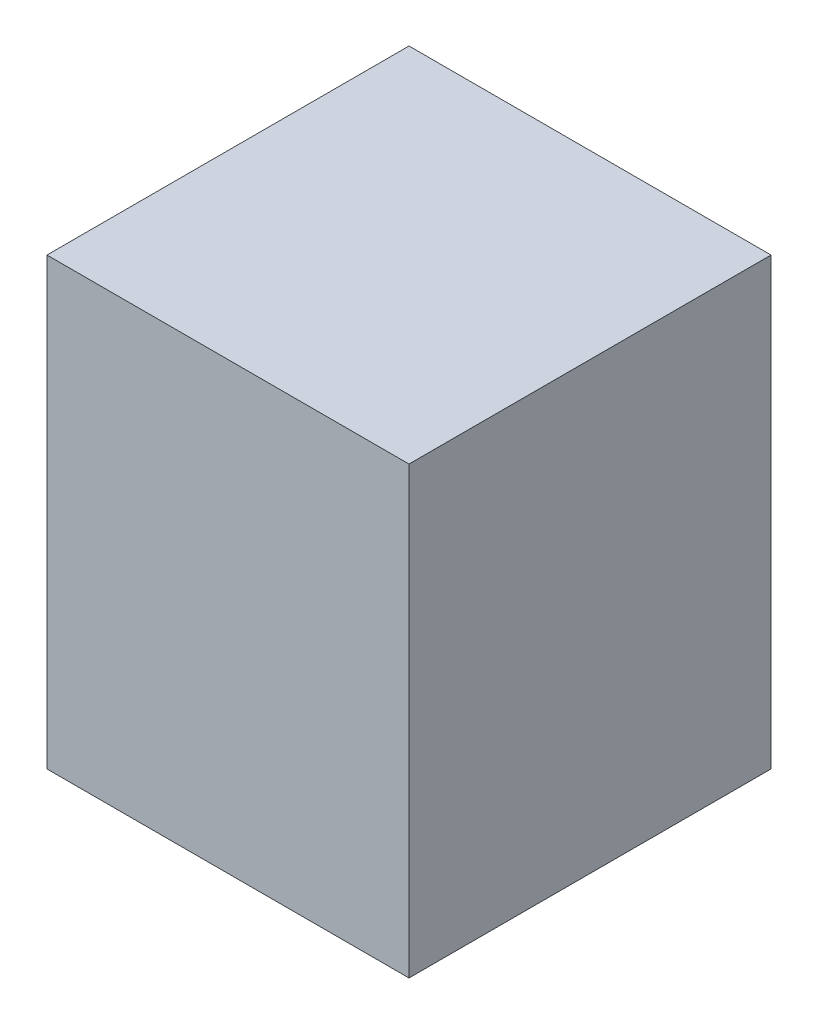
ISO-10303-21;
HEADER;
FILE_DESCRIPTION(('STEP AP214'),'2;1');
FILE_NAME('part.step','',(''),(''),'','','');
FILE_SCHEMA(('AUTOMOTIVE_DESIGN { 1 0 10303 214 1 1 1 1 }'));
ENDSEC;
DATA;
#1=APPLICATION_CONTEXT('core data for automotive mechanical design processes');
#2=APPLICATION_PROTOCOL_DEFINITION('international standard','automotive_design',2000,#1);
#3=PRODUCT_CONTEXT('',#1,'mechanical');
#4=PRODUCT('Part','Part','',(#3));
#5=PRODUCT_RELATED_PRODUCT_CATEGORY('part','',(#4));
#6=PRODUCT_DEFINITION_FORMATION('','',#4);
#7=PRODUCT_DEFINITION_CONTEXT('part definition',#1,'design');
#8=PRODUCT_DEFINITION('design','',#6,#7);
#9=PRODUCT_DEFINITION_SHAPE('','',#8);
#10=(LENGTH_UNIT() NAMED_UNIT(*) SI_UNIT(.MILLI.,.METRE.));
#11=(NAMED_UNIT(*) PLANE_ANGLE_UNIT() SI_UNIT($,.RADIAN.));
#12=(NAMED_UNIT(*) SI_UNIT($,.STERADIAN.) SOLID_ANGLE_UNIT());
#13=UNCERTAINTY_MEASURE_WITH_UNIT(LENGTH_MEASURE(1.E-05),#10,'distance_accuracy_value','');
#14=(GEOMETRIC_REPRESENTATION_CONTEXT(3) GLOBAL_UNCERTAINTY_ASSIGNED_CONTEXT((#13)) GLOBAL_UNIT_ASSIGNED_CONTEXT((#10,
#11,#12)) REPRESENTATION_CONTEXT('',''));
#15=CARTESIAN_POINT('',(0.,0.,0.));
#16=DIRECTION('',(0.,0.,1.));
#17=DIRECTION('',(1.,0.,0.));
#18=AXIS2_PLACEMENT_3D('',#15,#16,#17);
#19=CARTESIAN_POINT('',(193.675,238.125,193.675));
#20=DIRECTION('',(-1.,0.,0.));
#21=DIRECTION('',(0.,0.,1.));
#22=AXIS2_PLACEMENT_3D('',#19,#20,#21);
#23=PLANE('',#22);
#24=DIRECTION('',(0.,0.,-1.));
#25=VECTOR('',#24,1.);
#26=CARTESIAN_POINT('',(193.675,-238.125,193.675));
#27=LINE('',#26,#25);
#28=CARTESIAN_POINT('',(193.675,-238.125,193.675));
#29=VERTEX_POINT('',#28);
#30=CARTESIAN_POINT('',(193.675,-238.125,-193.675));
#31=VERTEX_POINT('',#30);
#32=EDGE_CURVE('E106',#29,#31,#27,.T.);
#33=ORIENTED_EDGE('',*,*,#32,.T.);
#34=DIRECTION('',(0.,-1.,0.));
#35=VECTOR('',#34,1.);
#36=CARTESIAN_POINT('',(193.675,238.125,-193.675));
#37=LINE('',#36,#35);
#38=CARTESIAN_POINT('',(193.675,238.125,-193.675));
#39=VERTEX_POINT('',#38);
#40=EDGE_CURVE('E11',#39,#31,#37,.T.);
#41=ORIENTED_EDGE('',*,*,#40,.F.);
#42=DIRECTION('',(0.,0.,-1.));
#43=VECTOR('',#42,1.);
#44=CARTESIAN_POINT('',(193.675,238.125,193.675));
#45=LINE('',#44,#43);
#46=CARTESIAN_POINT('',(193.675,238.125,193.675));
#47=VERTEX_POINT('',#46);
#48=EDGE_CURVE('E93',#47,#39,#45,.T.);
#49=ORIENTED_EDGE('',*,*,#48,.F.);
#50=DIRECTION('',(0.,-1.,0.));
#51=VECTOR('',#50,1.);
#52=CARTESIAN_POINT('',(193.675,238.125,193.675));
#53=LINE('',#52,#51);
#54=EDGE_CURVE('E102',#47,#29,#53,.T.);
#55=ORIENTED_EDGE('',*,*,#54,.T.);
#56=EDGE_LOOP('',(#33,#41,#49,#55));
#57=FACE_BOUND('',#56,.T.);
#58=ADVANCED_FACE('F40',(#57),#23,.F.);
#59=CARTESIAN_POINT('',(-193.675,238.125,-193.675));
#60=DIRECTION('',(0.,0.,1.));
#61=DIRECTION('',(1.,0.,0.));
#62=AXIS2_PLACEMENT_3D('',#59,#60,#61);
#63=PLANE('',#62);
#64=DIRECTION('',(-1.,0.,0.));
#65=VECTOR('',#64,1.);
#66=CARTESIAN_POINT('',(-193.675,-238.125,-193.675));
#67=LINE('',#66,#65);
#68=CARTESIAN_POINT('',(-193.675,-238.125,-193.675));
#69=VERTEX_POINT('',#68);
#70=EDGE_CURVE('E97',#31,#69,#67,.T.);
#71=ORIENTED_EDGE('',*,*,#70,.T.);
#72=DIRECTION('',(0.,-1.,0.));
#73=VECTOR('',#72,1.);
#74=CARTESIAN_POINT('',(-193.675,238.125,-193.675));
#75=LINE('',#74,#73);
#76=CARTESIAN_POINT('',(-193.675,238.125,-193.675));
#77=VERTEX_POINT('',#76);
#78=EDGE_CURVE('E49',#77,#69,#75,.T.);
#79=ORIENTED_EDGE('',*,*,#78,.F.);
#80=DIRECTION('',(-1.,0.,0.));
#81=VECTOR('',#80,1.);
#82=CARTESIAN_POINT('',(-193.675,238.125,-193.675));
#83=LINE('',#82,#81);
#84=EDGE_CURVE('E88',#39,#77,#83,.T.);
#85=ORIENTED_EDGE('',*,*,#84,.F.);
#86=ORIENTED_EDGE('',*,*,#40,.T.);
#87=EDGE_LOOP('',(#71,#79,#85,#86));
#88=FACE_BOUND('',#87,.T.);
#89=ADVANCED_FACE('F96',(#88),#63,.F.);
#90=CARTESIAN_POINT('',(-193.675,238.125,193.675));
#91=DIRECTION('',(1.,0.,0.));
#92=DIRECTION('',(0.,0.,-1.));
#93=AXIS2_PLACEMENT_3D('',#90,#91,#92);
#94=PLANE('',#93);
#95=DIRECTION('',(0.,0.,1.));
#96=VECTOR('',#95,1.);
#97=CARTESIAN_POINT('',(-193.675,-238.125,193.675));
#98=LINE('',#97,#96);
#99=CARTESIAN_POINT('',(-193.675,-238.125,193.675));
#100=VERTEX_POINT('',#99);
#101=EDGE_CURVE('E75',#69,#100,#98,.T.);
#102=ORIENTED_EDGE('',*,*,#101,.T.);
#103=DIRECTION('',(0.,-1.,0.));
#104=VECTOR('',#103,1.);
#105=CARTESIAN_POINT('',(-193.675,238.125,193.675));
#106=LINE('',#105,#104);
#107=CARTESIAN_POINT('',(-193.675,238.125,193.675));
#108=VERTEX_POINT('',#107);
#109=EDGE_CURVE('E98',#108,#100,#106,.T.);
#110=ORIENTED_EDGE('',*,*,#109,.F.);
#111=DIRECTION('',(0.,0.,1.));
#112=VECTOR('',#111,1.);
#113=CARTESIAN_POINT('',(-193.675,238.125,193.675));
#114=LINE('',#113,#112);
#115=EDGE_CURVE('E91',#77,#108,#114,.T.);
#116=ORIENTED_EDGE('',*,*,#115,.F.);
#117=ORIENTED_EDGE('',*,*,#78,.T.);
#118=EDGE_LOOP('',(#102,#110,#116,#117));
#119=FACE_BOUND('',#118,.T.);
#120=ADVANCED_FACE('F99',(#119),#94,.F.);
#121=CARTESIAN_POINT('',(-193.675,238.125,193.675));
#122=DIRECTION('',(0.,0.,-1.));
#123=DIRECTION('',(-1.,0.,0.));
#124=AXIS2_PLACEMENT_3D('',#121,#122,#123);
#125=PLANE('',#124);
#126=DIRECTION('',(1.,0.,0.));
#127=VECTOR('',#126,1.);
#128=CARTESIAN_POINT('',(-193.675,-238.125,193.675));
#129=LINE('',#128,#127);
#130=EDGE_CURVE('E81',#100,#29,#129,.T.);
#131=ORIENTED_EDGE('',*,*,#130,.T.);
#132=ORIENTED_EDGE('',*,*,#54,.F.);
#133=DIRECTION('',(1.,0.,0.));
#134=VECTOR('',#133,1.);
#135=CARTESIAN_POINT('',(-193.675,238.125,193.675));
#136=LINE('',#135,#134);
#137=EDGE_CURVE('E57',#108,#47,#136,.T.);
#138=ORIENTED_EDGE('',*,*,#137,.F.);
#139=ORIENTED_EDGE('',*,*,#109,.T.);
#140=EDGE_LOOP('',(#131,#132,#138,#139));
#141=FACE_BOUND('',#140,.T.);
#142=ADVANCED_FACE('F118',(#141),#125,.F.);
#143=CARTESIAN_POINT('',(0.,238.125,0.));
#144=DIRECTION('',(0.,-1.,0.));
#145=DIRECTION('',(0.,0.,-1.));
#146=AXIS2_PLACEMENT_3D('',#143,#144,#145);
#147=PLANE('',#146);
#148=ORIENTED_EDGE('',*,*,#48,.T.);
#149=ORIENTED_EDGE('',*,*,#84,.T.);
#150=ORIENTED_EDGE('',*,*,#115,.T.);
#151=ORIENTED_EDGE('',*,*,#137,.T.);
#152=EDGE_LOOP('',(#148,#149,#150,#151));
#153=FACE_BOUND('',#152,.T.);
#154=ADVANCED_FACE('F89',(#153),#147,.F.);
#155=CARTESIAN_POINT('',(0.,-238.125,0.));
#156=DIRECTION('',(0.,-1.,0.));
#157=DIRECTION('',(0.,0.,-1.));
#158=AXIS2_PLACEMENT_3D('',#155,#156,#157);
#159=PLANE('',#158);
#160=ORIENTED_EDGE('',*,*,#32,.F.);
#161=ORIENTED_EDGE('',*,*,#130,.F.);
#162=ORIENTED_EDGE('',*,*,#101,.F.);
#163=ORIENTED_EDGE('',*,*,#70,.F.);
#164=EDGE_LOOP('',(#160,#161,#162,#163));
#165=FACE_BOUND('',#164,.T.);
#166=ADVANCED_FACE('F121',(#165),#159,.T.);
#167=CLOSED_SHELL('',(#58,#89,#120,#142,#154,#166));
#168=MANIFOLD_SOLID_BREP('B2',#167);
#169=ADVANCED_BREP_SHAPE_REPRESENTATION('',(#18,#168),#14);
#170=SHAPE_DEFINITION_REPRESENTATION(#9,#169);
ENDSEC;
END-ISO-10303-21;
